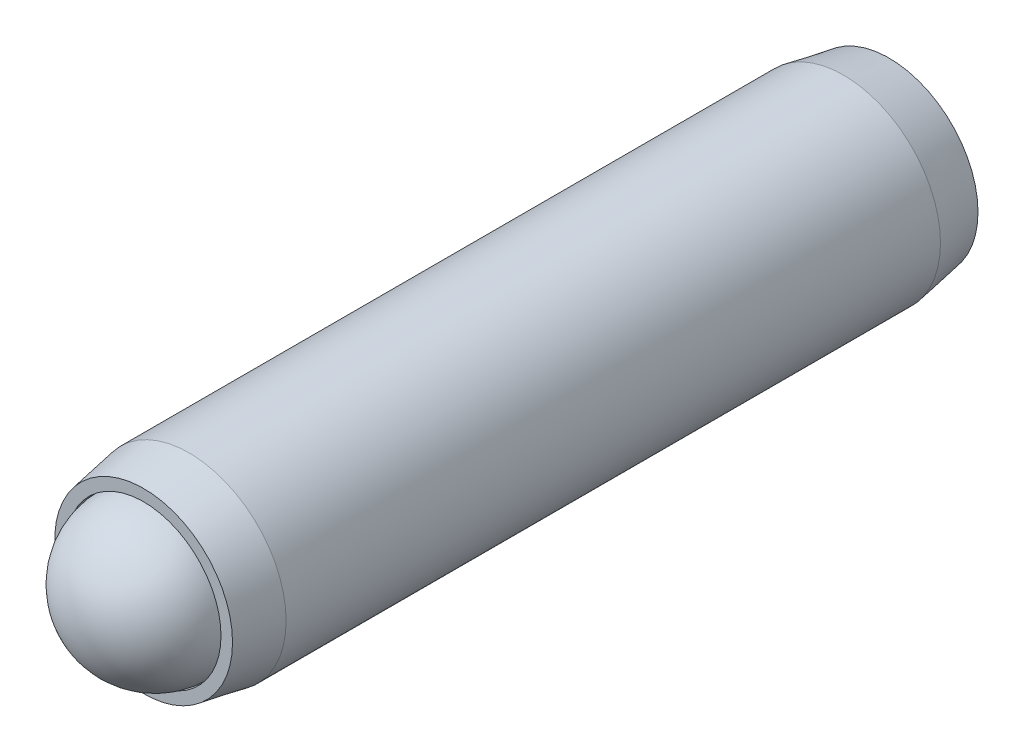
ISO-10303-21;
HEADER;
FILE_DESCRIPTION(('STEP AP214'),'2;1');
FILE_NAME('part.step','',(''),(''),'','','');
FILE_SCHEMA(('AUTOMOTIVE_DESIGN { 1 0 10303 214 1 1 1 1 }'));
ENDSEC;
DATA;
#1=APPLICATION_CONTEXT('core data for automotive mechanical design processes');
#2=APPLICATION_PROTOCOL_DEFINITION('international standard','automotive_design',2000,#1);
#3=PRODUCT_CONTEXT('',#1,'mechanical');
#4=PRODUCT('Part','Part','',(#3));
#5=PRODUCT_RELATED_PRODUCT_CATEGORY('part','',(#4));
#6=PRODUCT_DEFINITION_FORMATION('','',#4);
#7=PRODUCT_DEFINITION_CONTEXT('part definition',#1,'design');
#8=PRODUCT_DEFINITION('design','',#6,#7);
#9=PRODUCT_DEFINITION_SHAPE('','',#8);
#10=(LENGTH_UNIT() NAMED_UNIT(*) SI_UNIT(.MILLI.,.METRE.));
#11=(NAMED_UNIT(*) PLANE_ANGLE_UNIT() SI_UNIT($,.RADIAN.));
#12=(NAMED_UNIT(*) SI_UNIT($,.STERADIAN.) SOLID_ANGLE_UNIT());
#13=UNCERTAINTY_MEASURE_WITH_UNIT(LENGTH_MEASURE(1.E-05),#10,'distance_accuracy_value','');
#14=(GEOMETRIC_REPRESENTATION_CONTEXT(3) GLOBAL_UNCERTAINTY_ASSIGNED_CONTEXT((#13)) GLOBAL_UNIT_ASSIGNED_CONTEXT((#10,
#11,#12)) REPRESENTATION_CONTEXT('',''));
#15=CARTESIAN_POINT('',(0.,0.,0.));
#16=DIRECTION('',(0.,0.,1.));
#17=DIRECTION('',(1.,0.,0.));
#18=AXIS2_PLACEMENT_3D('',#15,#16,#17);
#19=CARTESIAN_POINT('',(0.,0.,11.500000019));
#20=DIRECTION('',(0.,0.,-1.));
#21=DIRECTION('',(-1.,0.,0.));
#22=AXIS2_PLACEMENT_3D('',#19,#20,#21);
#23=CYLINDRICAL_SURFACE('',#22,2.991);
#24=CARTESIAN_POINT('',(0.,0.,10.0946563840987));
#25=DIRECTION('',(0.,0.,1.));
#26=DIRECTION('',(1.,0.,0.));
#27=AXIS2_PLACEMENT_3D('',#24,#25,#26);
#28=CIRCLE('',#27,2.991);
#29=CARTESIAN_POINT('',(2.991,0.,10.0946563840987));
#30=VERTEX_POINT('',#29);
#31=EDGE_CURVE('P0_E184',#30,#30,#28,.T.);
#32=ORIENTED_EDGE('',*,*,#31,.F.);
#33=EDGE_LOOP('',(#32));
#34=FACE_BOUND('',#33,.T.);
#35=CARTESIAN_POINT('',(0.,0.,-10.0946563840987));
#36=DIRECTION('',(0.,0.,1.));
#37=DIRECTION('',(1.,0.,0.));
#38=AXIS2_PLACEMENT_3D('',#35,#36,#37);
#39=CIRCLE('',#38,2.991);
#40=CARTESIAN_POINT('',(2.991,0.,-10.0946563840987));
#41=VERTEX_POINT('',#40);
#42=EDGE_CURVE('P0_E187',#41,#41,#39,.T.);
#43=ORIENTED_EDGE('',*,*,#42,.T.);
#44=EDGE_LOOP('',(#43));
#45=FACE_BOUND('',#44,.T.);
#46=ADVANCED_FACE('P0_F16',(#34,#45),#23,.T.);
#47=CARTESIAN_POINT('',(0.,0.,11.500000019));
#48=DIRECTION('',(0.,0.,-1.));
#49=DIRECTION('',(-1.,0.,0.));
#50=AXIS2_PLACEMENT_3D('',#47,#48,#49);
#51=CONICAL_SURFACE('',#50,2.7432,0.174532925199426);
#52=ORIENTED_EDGE('',*,*,#31,.T.);
#53=EDGE_LOOP('',(#52));
#54=FACE_BOUND('',#53,.T.);
#55=CARTESIAN_POINT('',(0.,0.,11.500000019));
#56=DIRECTION('',(0.,0.,1.));
#57=DIRECTION('',(1.,0.,0.));
#58=AXIS2_PLACEMENT_3D('',#55,#56,#57);
#59=CIRCLE('',#58,2.7432);
#60=CARTESIAN_POINT('',(2.7432,0.,11.500000019));
#61=VERTEX_POINT('',#60);
#62=EDGE_CURVE('P0_E200',#61,#61,#59,.T.);
#63=ORIENTED_EDGE('',*,*,#62,.F.);
#64=EDGE_LOOP('',(#63));
#65=FACE_BOUND('',#64,.T.);
#66=ADVANCED_FACE('P0_F162',(#54,#65),#51,.T.);
#67=CARTESIAN_POINT('',(0.,0.,11.500000019));
#68=DIRECTION('',(0.,0.,1.));
#69=DIRECTION('',(1.,0.,0.));
#70=AXIS2_PLACEMENT_3D('',#67,#68,#69);
#71=PLANE('',#70);
#72=CARTESIAN_POINT('',(0.,0.,11.500000019));
#73=DIRECTION('',(0.,0.,1.));
#74=DIRECTION('',(1.,0.,0.));
#75=AXIS2_PLACEMENT_3D('',#72,#73,#74);
#76=CIRCLE('',#75,2.3876);
#77=CARTESIAN_POINT('',(2.3876,0.,11.500000019));
#78=VERTEX_POINT('',#77);
#79=EDGE_CURVE('P0_E195',#78,#78,#76,.T.);
#80=ORIENTED_EDGE('',*,*,#79,.F.);
#81=EDGE_LOOP('',(#80));
#82=FACE_BOUND('',#81,.T.);
#83=ORIENTED_EDGE('',*,*,#62,.T.);
#84=EDGE_LOOP('',(#83));
#85=FACE_BOUND('',#84,.T.);
#86=ADVANCED_FACE('P0_F159',(#82,#85),#71,.T.);
#87=CARTESIAN_POINT('',(0.,0.,-10.0946563840987));
#88=DIRECTION('',(0.,0.,1.));
#89=DIRECTION('',(1.,0.,0.));
#90=AXIS2_PLACEMENT_3D('',#87,#88,#89);
#91=CONICAL_SURFACE('',#90,2.991,0.174532925199426);
#92=CARTESIAN_POINT('',(0.,0.,-11.500000019));
#93=DIRECTION('',(0.,0.,1.));
#94=DIRECTION('',(1.,0.,0.));
#95=AXIS2_PLACEMENT_3D('',#92,#93,#94);
#96=CIRCLE('',#95,2.7432);
#97=CARTESIAN_POINT('',(2.7432,0.,-11.500000019));
#98=VERTEX_POINT('',#97);
#99=EDGE_CURVE('P0_E189',#98,#98,#96,.T.);
#100=ORIENTED_EDGE('',*,*,#99,.T.);
#101=EDGE_LOOP('',(#100));
#102=FACE_BOUND('',#101,.T.);
#103=ORIENTED_EDGE('',*,*,#42,.F.);
#104=EDGE_LOOP('',(#103));
#105=FACE_BOUND('',#104,.T.);
#106=ADVANCED_FACE('P0_F161',(#102,#105),#91,.T.);
#107=CARTESIAN_POINT('',(0.,0.,-11.500000019));
#108=DIRECTION('',(0.,0.,1.));
#109=DIRECTION('',(1.,0.,0.));
#110=AXIS2_PLACEMENT_3D('',#107,#108,#109);
#111=PLANE('',#110);
#112=CARTESIAN_POINT('',(0.,0.,-11.500000019));
#113=DIRECTION('',(0.,0.,1.));
#114=DIRECTION('',(1.,0.,0.));
#115=AXIS2_PLACEMENT_3D('',#112,#113,#114);
#116=CIRCLE('',#115,1.14567944042316);
#117=CARTESIAN_POINT('',(0.572839720211583,-0.992187499999999,-11.500000019));
#118=VERTEX_POINT('',#117);
#119=CARTESIAN_POINT('',(1.14567944042316,0.,-11.500000019));
#120=VERTEX_POINT('',#119);
#121=EDGE_CURVE('P0_E19',#118,#120,#116,.T.);
#122=ORIENTED_EDGE('',*,*,#121,.T.);
#123=CARTESIAN_POINT('',(0.572839720211582,0.9921875,-11.500000019));
#124=VERTEX_POINT('',#123);
#125=EDGE_CURVE('P0_E11',#120,#124,#116,.T.);
#126=ORIENTED_EDGE('',*,*,#125,.T.);
#127=CARTESIAN_POINT('',(-0.572839720211582,0.9921875,-11.500000019));
#128=VERTEX_POINT('',#127);
#129=EDGE_CURVE('P0_E24',#124,#128,#116,.T.);
#130=ORIENTED_EDGE('',*,*,#129,.T.);
#131=CARTESIAN_POINT('',(0.,0.,-11.500000019));
#132=DIRECTION('',(0.,0.,-1.));
#133=DIRECTION('',(-1.,0.,0.));
#134=AXIS2_PLACEMENT_3D('',#131,#132,#133);
#135=CIRCLE('',#134,1.14567944042316);
#136=CARTESIAN_POINT('',(-1.14567944042316,0.,-11.500000019));
#137=VERTEX_POINT('',#136);
#138=EDGE_CURVE('P0_E77',#137,#128,#135,.T.);
#139=ORIENTED_EDGE('',*,*,#138,.F.);
#140=CARTESIAN_POINT('',(-0.572839720211581,-0.9921875,-11.500000019));
#141=VERTEX_POINT('',#140);
#142=EDGE_CURVE('P0_E85',#137,#141,#116,.T.);
#143=ORIENTED_EDGE('',*,*,#142,.T.);
#144=EDGE_CURVE('P0_E90',#141,#118,#116,.T.);
#145=ORIENTED_EDGE('',*,*,#144,.T.);
#146=EDGE_LOOP('',(#122,#126,#130,#139,#143,#145));
#147=FACE_BOUND('',#146,.T.);
#148=ORIENTED_EDGE('',*,*,#99,.F.);
#149=EDGE_LOOP('',(#148));
#150=FACE_BOUND('',#149,.T.);
#151=ADVANCED_FACE('P0_F91',(#147,#150),#111,.F.);
#152=CARTESIAN_POINT('',(0.,0.,10.1644039735991));
#153=DIRECTION('',(0.,0.,1.));
#154=DIRECTION('',(1.,0.,0.));
#155=AXIS2_PLACEMENT_3D('',#152,#153,#154);
#156=CONICAL_SURFACE('',#155,2.3876,0.78539816339745);
#157=CARTESIAN_POINT('',(0.,0.,7.77680397359907));
#158=VERTEX_POINT('',#157);
#159=VERTEX_LOOP('',#158);
#160=FACE_BOUND('',#159,.T.);
#161=CARTESIAN_POINT('',(0.,0.,10.1644039735991));
#162=DIRECTION('',(0.,0.,1.));
#163=DIRECTION('',(1.,0.,0.));
#164=AXIS2_PLACEMENT_3D('',#161,#162,#163);
#165=CIRCLE('',#164,2.3876);
#166=CARTESIAN_POINT('',(2.3876,0.,10.1644039735991));
#167=VERTEX_POINT('',#166);
#168=EDGE_CURVE('P0_E190',#167,#167,#165,.T.);
#169=ORIENTED_EDGE('',*,*,#168,.T.);
#170=EDGE_LOOP('',(#169));
#171=FACE_BOUND('',#170,.T.);
#172=ADVANCED_FACE('P0_F165',(#160,#171),#156,.F.);
#173=CARTESIAN_POINT('',(0.,0.,11.500000019));
#174=DIRECTION('',(0.,0.,1.));
#175=DIRECTION('',(1.,0.,0.));
#176=AXIS2_PLACEMENT_3D('',#173,#174,#175);
#177=CYLINDRICAL_SURFACE('',#176,2.3876);
#178=ORIENTED_EDGE('',*,*,#168,.F.);
#179=EDGE_LOOP('',(#178));
#180=FACE_BOUND('',#179,.T.);
#181=ORIENTED_EDGE('',*,*,#79,.T.);
#182=EDGE_LOOP('',(#181));
#183=FACE_BOUND('',#182,.T.);
#184=ADVANCED_FACE('P0_F132',(#180,#183),#177,.F.);
#185=CARTESIAN_POINT('',(0.,0.,-11.500000019));
#186=DIRECTION('',(0.,0.,-1.));
#187=DIRECTION('',(-1.,0.,0.));
#188=AXIS2_PLACEMENT_3D('',#185,#186,#187);
#189=CONICAL_SURFACE('',#188,1.14567944042316,0.78539816339745);
#190=ORIENTED_EDGE('',*,*,#121,.F.);
#191=CARTESIAN_POINT('',(1.145794910477,0.000200000000000163,-11.500115506509));
#192=CARTESIAN_POINT('',(1.12609913995856,-0.0339140752321557,-11.4804328304047));
#193=CARTESIAN_POINT('',(1.10607402631377,-0.0685985894922792,-11.4619057035184));
#194=CARTESIAN_POINT('',(1.06524035596264,-0.139324581199959,-11.4279823486504));
#195=CARTESIAN_POINT('',(1.04442791197037,-0.175372791624242,-11.4126050062309));
#196=CARTESIAN_POINT('',(1.00246048249572,-0.248062511737395,-11.3862631617343));
#197=CARTESIAN_POINT('',(0.981316196707012,-0.284685489013201,-11.3752324155131));
#198=CARTESIAN_POINT('',(0.938562244623588,-0.358737506246056,-11.3582362246729));
#199=CARTESIAN_POINT('',(0.916953885244212,-0.396164282559342,-11.3522580865789));
#200=CARTESIAN_POINT('',(0.879714587318154,-0.46066463860547,-11.3468663639143));
#201=CARTESIAN_POINT('',(0.864132099442442,-0.487654299314529,-11.3460690153883));
#202=CARTESIAN_POINT('',(0.832997298779852,-0.541581355945663,-11.3474082123614));
#203=CARTESIAN_POINT('',(0.817444993408173,-0.568518739024239,-11.349545405137));
#204=CARTESIAN_POINT('',(0.771010163908484,-0.648946222958497,-11.360217590306));
#205=CARTESIAN_POINT('',(0.740358726795446,-0.702036069363282,-11.3730143997227));
#206=CARTESIAN_POINT('',(0.68656205513008,-0.795214637965797,-11.4038974866501));
#207=CARTESIAN_POINT('',(0.663164549602744,-0.835740306309516,-11.4203650279077));
#208=CARTESIAN_POINT('',(0.617285982385523,-0.915204315708207,-11.4574604025568));
#209=CARTESIAN_POINT('',(0.594802217831308,-0.954147338261523,-11.4780746996455));
#210=CARTESIAN_POINT('',(0.572724250157744,-0.992387499999999,-11.500115506509));
#211=B_SPLINE_CURVE_WITH_KNOTS('',3,(#191,#192,#193,#194,#195,#196,#197,#198,#199,#200,#201,
#202,#203,#204,#205,#206,#207,#208,#209,#210),.UNSPECIFIED.,.F.,.F.,(4,2,2,2,2,2,2,2,2,4),(0.,
0.13219718521019,0.265165186853262,0.396020097605669,0.526545281028574,0.619935205043264,
0.713345731536164,0.900220051846369,1.04884529769095,1.1969930355767),.UNSPECIFIED.);
#212=EDGE_CURVE('P0_E109',#120,#118,#211,.T.);
#213=ORIENTED_EDGE('',*,*,#212,.F.);
#214=EDGE_LOOP('',(#190,#213));
#215=FACE_BOUND('',#214,.T.);
#216=ADVANCED_FACE('P0_F127',(#215),#189,.F.);
#217=ORIENTED_EDGE('',*,*,#144,.F.);
#218=CARTESIAN_POINT('',(-1.14247621095534,-0.9921875,-11.8674920585338));
#219=CARTESIAN_POINT('',(-1.11465764817297,-0.9921875,-11.8464916583704));
#220=CARTESIAN_POINT('',(-1.08668408109739,-0.9921875,-11.8256971668216));
#221=CARTESIAN_POINT('',(-1.03036405380652,-0.9921875,-11.7846050567931));
#222=CARTESIAN_POINT('',(-1.00201750238008,-0.9921875,-11.7643075634585));
#223=CARTESIAN_POINT('',(-0.915909012474785,-0.9921875,-11.7039985265809));
#224=CARTESIAN_POINT('',(-0.857501195957519,-0.9921875,-11.66489387125));
#225=CARTESIAN_POINT('',(-0.735022281337406,-0.9921875,-11.5881267718187));
#226=CARTESIAN_POINT('',(-0.670818221979873,-0.9921875,-11.5506740500437));
#227=CARTESIAN_POINT('',(-0.539203244273796,-0.9921875,-11.4821650394898));
#228=CARTESIAN_POINT('',(-0.471804119013398,-0.9921875,-11.4510871872744));
#229=CARTESIAN_POINT('',(-0.370637445291612,-0.9921875,-11.41306631525));
#230=CARTESIAN_POINT('',(-0.338367677294405,-0.9921875,-11.4021540513464));
#231=CARTESIAN_POINT('',(-0.273049086298105,-0.9921875,-11.382920249113));
#232=CARTESIAN_POINT('',(-0.240000209797913,-0.9921875,-11.3745988892603));
#233=CARTESIAN_POINT('',(-0.17387839587922,-0.9921875,-11.3611187926932));
#234=CARTESIAN_POINT('',(-0.140816774783575,-0.9921875,-11.3559054129747));
#235=CARTESIAN_POINT('',(-0.0743291672741469,-0.9921875,-11.3487397314628));
#236=CARTESIAN_POINT('',(-0.0409031260707386,-0.9921875,-11.3467879270388));
#237=CARTESIAN_POINT('',(0.0247631140270445,-0.9921875,-11.3462935049037));
#238=CARTESIAN_POINT('',(0.0570024444112249,-0.9921875,-11.3476300504157));
#239=CARTESIAN_POINT('',(0.121194220405733,-0.9921875,-11.3533710622024));
#240=CARTESIAN_POINT('',(0.15314673026799,-0.9921875,-11.3577748230789));
#241=CARTESIAN_POINT('',(0.21709052455367,-0.9921875,-11.3694845301375));
#242=CARTESIAN_POINT('',(0.249072542042748,-0.9921875,-11.3768403214107));
#243=CARTESIAN_POINT('',(0.312337779646054,-0.9921875,-11.3940631103517));
#244=CARTESIAN_POINT('',(0.343621057993189,-0.9921875,-11.4039298978974));
#245=CARTESIAN_POINT('',(0.442112982998623,-0.9921875,-11.4387061305409));
#246=CARTESIAN_POINT('',(0.507919771037745,-0.9921875,-11.467576183078));
#247=CARTESIAN_POINT('',(0.63644189098175,-0.9921875,-11.5317652288148));
#248=CARTESIAN_POINT('',(0.699145053739843,-0.9921875,-11.5671073910824));
#249=CARTESIAN_POINT('',(0.818979829838881,-0.9921875,-11.6400213897045));
#250=CARTESIAN_POINT('',(0.876233471440126,-0.9921875,-11.6773951538683));
#251=CARTESIAN_POINT('',(0.960585190489399,-0.9921875,-11.7351711306989));
#252=CARTESIAN_POINT('',(0.988338378120949,-0.9921875,-11.754633506457));
#253=CARTESIAN_POINT('',(1.04346551309539,-0.9921875,-11.7940730005409));
#254=CARTESIAN_POINT('',(1.070839562073,-0.9921875,-11.8140499766456));
#255=CARTESIAN_POINT('',(1.09805574489947,-0.9921875,-11.8342403243952));
#256=B_SPLINE_CURVE_WITH_KNOTS('',3,(#218,#219,#220,#221,#222,#223,#224,#225,#226,#227,#228,
#229,#230,#231,#232,#233,#234,#235,#236,#237,#238,#239,#240,#241,#242,#243,#244,#245,#246,#247,
#248,#249,#250,#251,#252,#253,#254,#255),.UNSPECIFIED.,.F.,.F.,(4,2,2,2,2,2,2,2,2,2,2,2,2,2,2,2,
2,2,4),(0.,0.104563127391606,0.209152318718919,0.419927099055485,0.642732653996012,
0.864771652302187,0.966879847198757,1.06899507437088,1.1692575299655,1.2695352735478,
1.36618351698525,1.4628095406014,1.56114078104352,1.65946379575192,1.87441437169281,
2.090150036015,2.29516517561955,2.39685303361285,2.4985130831926),.UNSPECIFIED.);
#257=EDGE_CURVE('P0_E107',#118,#141,#256,.F.);
#258=ORIENTED_EDGE('',*,*,#257,.F.);
#259=EDGE_LOOP('',(#217,#258));
#260=FACE_BOUND('',#259,.T.);
#261=ADVANCED_FACE('P0_F131',(#260),#189,.F.);
#262=ORIENTED_EDGE('',*,*,#142,.F.);
#263=CARTESIAN_POINT('',(-0.572724250157744,-0.9923875,-11.500115506509));
#264=CARTESIAN_POINT('',(-0.592420020676184,-0.958273424767844,-11.4804328304047));
#265=CARTESIAN_POINT('',(-0.612445134320978,-0.923588910507721,-11.4619057035184));
#266=CARTESIAN_POINT('',(-0.65327880467211,-0.852862918800041,-11.4279823486504));
#267=CARTESIAN_POINT('',(-0.674091248664374,-0.816814708375758,-11.4126050062309));
#268=CARTESIAN_POINT('',(-0.716058678139021,-0.744124988262605,-11.3862631617343));
#269=CARTESIAN_POINT('',(-0.737202963927733,-0.7075020109868,-11.3752324155131));
#270=CARTESIAN_POINT('',(-0.779956916011157,-0.633449993753945,-11.3582362246729));
#271=CARTESIAN_POINT('',(-0.801565275390533,-0.596023217440658,-11.3522580865789));
#272=CARTESIAN_POINT('',(-0.838804573316591,-0.53152286139453,-11.3468663639143));
#273=CARTESIAN_POINT('',(-0.854387061192303,-0.504533200685471,-11.3460690153883));
#274=CARTESIAN_POINT('',(-0.885521861854893,-0.450606144054336,-11.3474082123614));
#275=CARTESIAN_POINT('',(-0.901074167226572,-0.423668760975761,-11.349545405137));
#276=CARTESIAN_POINT('',(-0.94750899672626,-0.343241277041503,-11.360217590306));
#277=CARTESIAN_POINT('',(-0.978160433839299,-0.290151430636718,-11.3730143997227));
#278=CARTESIAN_POINT('',(-1.03195710550467,-0.196972862034203,-11.4038974866501));
#279=CARTESIAN_POINT('',(-1.055354611032,-0.156447193690484,-11.4203650279077));
#280=CARTESIAN_POINT('',(-1.10123317824922,-0.0769831842917928,-11.4574604025568));
#281=CARTESIAN_POINT('',(-1.12371694280344,-0.0380401617384767,-11.4780746996455));
#282=CARTESIAN_POINT('',(-1.145794910477,0.000199999999999656,-11.500115506509));
#283=B_SPLINE_CURVE_WITH_KNOTS('',3,(#263,#264,#265,#266,#267,#268,#269,#270,#271,#272,#273,
#274,#275,#276,#277,#278,#279,#280,#281,#282),.UNSPECIFIED.,.F.,.F.,(4,2,2,2,2,2,2,2,2,4),(0.,
0.132197185210189,0.265165186853262,0.396020097605668,0.526545281028573,0.619935205043264,
0.713345731536163,0.900220051846368,1.04884529769095,1.19699303557669),.UNSPECIFIED.);
#284=EDGE_CURVE('P0_E80',#141,#137,#283,.T.);
#285=ORIENTED_EDGE('',*,*,#284,.F.);
#286=EDGE_LOOP('',(#262,#285));
#287=FACE_BOUND('',#286,.T.);
#288=ADVANCED_FACE('P0_F86',(#287),#189,.F.);
#289=ORIENTED_EDGE('',*,*,#138,.T.);
#290=CARTESIAN_POINT('',(-1.145794910477,-0.000200000000000018,-11.500115506509));
#291=CARTESIAN_POINT('',(-1.12609913995856,0.0339140752321558,-11.4804328304047));
#292=CARTESIAN_POINT('',(-1.10607402631377,0.0685985894922792,-11.4619057035184));
#293=CARTESIAN_POINT('',(-1.06524035596264,0.139324581199959,-11.4279823486504));
#294=CARTESIAN_POINT('',(-1.04442791197037,0.175372791624242,-11.4126050062309));
#295=CARTESIAN_POINT('',(-1.00246048249572,0.248062511737395,-11.3862631617343));
#296=CARTESIAN_POINT('',(-0.981316196707012,0.2846854890132,-11.3752324155131));
#297=CARTESIAN_POINT('',(-0.938562244623589,0.358737506246055,-11.3582362246729));
#298=CARTESIAN_POINT('',(-0.916953885244213,0.396164282559342,-11.3522580865789));
#299=CARTESIAN_POINT('',(-0.879714587318154,0.46066463860547,-11.3468663639143));
#300=CARTESIAN_POINT('',(-0.864132099442442,0.487654299314528,-11.3460690153883));
#301=CARTESIAN_POINT('',(-0.832997298779853,0.541581355945663,-11.3474082123614));
#302=CARTESIAN_POINT('',(-0.817444993408173,0.568518739024238,-11.349545405137));
#303=CARTESIAN_POINT('',(-0.771010163908485,0.648946222958496,-11.360217590306));
#304=CARTESIAN_POINT('',(-0.740358726795446,0.702036069363281,-11.3730143997227));
#305=CARTESIAN_POINT('',(-0.68656205513008,0.795214637965796,-11.4038974866501));
#306=CARTESIAN_POINT('',(-0.663164549602745,0.835740306309515,-11.4203650279077));
#307=CARTESIAN_POINT('',(-0.617285982385523,0.915204315708207,-11.4574604025568));
#308=CARTESIAN_POINT('',(-0.594802217831308,0.954147338261523,-11.4780746996455));
#309=CARTESIAN_POINT('',(-0.572724250157744,0.9923875,-11.500115506509));
#310=B_SPLINE_CURVE_WITH_KNOTS('',3,(#290,#291,#292,#293,#294,#295,#296,#297,#298,#299,#300,
#301,#302,#303,#304,#305,#306,#307,#308,#309),.UNSPECIFIED.,.F.,.F.,(4,2,2,2,2,2,2,2,2,4),(0.,
0.132197185210189,0.265165186853262,0.396020097605669,0.526545281028573,0.619935205043263,
0.713345731536163,0.900220051846368,1.04884529769095,1.1969930355767),.UNSPECIFIED.);
#311=EDGE_CURVE('P0_E73',#137,#128,#310,.T.);
#312=ORIENTED_EDGE('',*,*,#311,.F.);
#313=EDGE_LOOP('',(#289,#312));
#314=FACE_BOUND('',#313,.T.);
#315=ADVANCED_FACE('P0_F75',(#314),#189,.F.);
#316=ORIENTED_EDGE('',*,*,#129,.F.);
#317=CARTESIAN_POINT('',(-1.14247621078911,0.9921875,-11.8674920584083));
#318=CARTESIAN_POINT('',(-1.11465764801141,0.9921875,-11.8464916582497));
#319=CARTESIAN_POINT('',(-1.08668408094051,0.9921875,-11.8256971667058));
#320=CARTESIAN_POINT('',(-1.03036405365905,0.9921875,-11.7846050566869));
#321=CARTESIAN_POINT('',(-1.00201750223733,0.9921875,-11.7643075633571));
#322=CARTESIAN_POINT('',(-0.915909012346497,0.9921875,-11.7039985264939));
#323=CARTESIAN_POINT('',(-0.857501195839068,0.9921875,-11.6648938711726));
#324=CARTESIAN_POINT('',(-0.735022281240406,0.9921875,-11.5881267717611));
#325=CARTESIAN_POINT('',(-0.670818221894544,0.9921875,-11.5506740499963));
#326=CARTESIAN_POINT('',(-0.539203244212804,0.9921875,-11.482165039461));
#327=CARTESIAN_POINT('',(-0.471804118965062,0.9921875,-11.4510871872543));
#328=CARTESIAN_POINT('',(-0.370637445252798,0.9921875,-11.4130663152363));
#329=CARTESIAN_POINT('',(-0.338367677251604,0.9921875,-11.4021540513325));
#330=CARTESIAN_POINT('',(-0.273049086247197,0.9921875,-11.3829202490993));
#331=CARTESIAN_POINT('',(-0.240000209742887,0.9921875,-11.3745988892472));
#332=CARTESIAN_POINT('',(-0.173878395816094,0.9921875,-11.3611187926821));
#333=CARTESIAN_POINT('',(-0.140816774716471,0.9921875,-11.3559054129651));
#334=CARTESIAN_POINT('',(-0.0743291671992148,0.9921875,-11.3487397314571));
#335=CARTESIAN_POINT('',(-0.0409031259919581,0.9921875,-11.3467879270354));
#336=CARTESIAN_POINT('',(0.0247631141129246,0.9921875,-11.3462935049057));
#337=CARTESIAN_POINT('',(0.0570024445003661,0.9921875,-11.3476300504208));
#338=CARTESIAN_POINT('',(0.12119422050107,0.9921875,-11.3533710622138));
#339=CARTESIAN_POINT('',(0.153146730366262,0.9921875,-11.3577748230939));
#340=CARTESIAN_POINT('',(0.217090524657736,0.9921875,-11.3694845301597));
#341=CARTESIAN_POINT('',(0.249072542149665,0.9921875,-11.3768403214366));
#342=CARTESIAN_POINT('',(0.312337779758396,0.9921875,-11.3940631103854));
#343=CARTESIAN_POINT('',(0.343621058108106,0.9921875,-11.403929897935));
#344=CARTESIAN_POINT('',(0.442112983138562,0.9921875,-11.4387061305969));
#345=CARTESIAN_POINT('',(0.50791977119888,0.9921875,-11.4675761831508));
#346=CARTESIAN_POINT('',(0.636441891183645,0.9921875,-11.5317652289233));
#347=CARTESIAN_POINT('',(0.699145053961295,0.9921875,-11.5671073912097));
#348=CARTESIAN_POINT('',(0.818979830095495,0.9921875,-11.6400213898677));
#349=CARTESIAN_POINT('',(0.87623347171247,0.9921875,-11.6773951540485));
#350=CARTESIAN_POINT('',(0.960585190785,0.9921875,-11.7351711309045));
#351=CARTESIAN_POINT('',(0.98833837842419,0.9921875,-11.754633506671));
#352=CARTESIAN_POINT('',(1.04346551341387,0.9921875,-11.7940730007717));
#353=CARTESIAN_POINT('',(1.07083956239906,0.9921875,-11.8140499768848));
#354=CARTESIAN_POINT('',(1.09805574523311,0.9921875,-11.8342403246427));
#355=B_SPLINE_CURVE_WITH_KNOTS('',3,(#317,#318,#319,#320,#321,#322,#323,#324,#325,#326,#327,
#328,#329,#330,#331,#332,#333,#334,#335,#336,#337,#338,#339,#340,#341,#342,#343,#344,#345,#346,
#347,#348,#349,#350,#351,#352,#353,#354),.UNSPECIFIED.,.F.,.F.,(4,2,2,2,2,2,2,2,2,2,2,2,2,2,2,2,
2,2,4),(0.,0.104563127371704,0.209152318679109,0.419927098975113,0.642732653870156,
0.864771652131278,0.96687984703938,1.06899507422301,1.16925752982867,1.26953527342202,
1.36618351686957,1.46280954049584,1.56114078094885,1.65946379566814,1.87441437168727,
2.09015003608822,2.29516517576017,2.39685303378669,2.49851308339968),.UNSPECIFIED.);
#356=EDGE_CURVE('P0_E81',#128,#124,#355,.T.);
#357=ORIENTED_EDGE('',*,*,#356,.F.);
#358=EDGE_LOOP('',(#316,#357));
#359=FACE_BOUND('',#358,.T.);
#360=ADVANCED_FACE('P0_F231',(#359),#189,.F.);
#361=ORIENTED_EDGE('',*,*,#125,.F.);
#362=CARTESIAN_POINT('',(0.572724250157744,0.9923875,-11.500115506509));
#363=CARTESIAN_POINT('',(0.592420020676184,0.958273424767844,-11.4804328304047));
#364=CARTESIAN_POINT('',(0.612445134320978,0.923588910507721,-11.4619057035184));
#365=CARTESIAN_POINT('',(0.65327880467211,0.852862918800041,-11.4279823486504));
#366=CARTESIAN_POINT('',(0.674091248664374,0.816814708375758,-11.4126050062309));
#367=CARTESIAN_POINT('',(0.716058678139022,0.744124988262605,-11.3862631617343));
#368=CARTESIAN_POINT('',(0.737202963927733,0.7075020109868,-11.3752324155131));
#369=CARTESIAN_POINT('',(0.779956916011157,0.633449993753945,-11.3582362246729));
#370=CARTESIAN_POINT('',(0.801565275390533,0.596023217440658,-11.3522580865789));
#371=CARTESIAN_POINT('',(0.838804573316592,0.53152286139453,-11.3468663639143));
#372=CARTESIAN_POINT('',(0.854387061192303,0.504533200685472,-11.3460690153883));
#373=CARTESIAN_POINT('',(0.885521861854893,0.450606144054337,-11.3474082123614));
#374=CARTESIAN_POINT('',(0.901074167226572,0.423668760975762,-11.349545405137));
#375=CARTESIAN_POINT('',(0.94750899672626,0.343241277041504,-11.360217590306));
#376=CARTESIAN_POINT('',(0.978160433839299,0.290151430636718,-11.3730143997227));
#377=CARTESIAN_POINT('',(1.03195710550467,0.196972862034204,-11.4038974866501));
#378=CARTESIAN_POINT('',(1.055354611032,0.156447193690484,-11.4203650279077));
#379=CARTESIAN_POINT('',(1.10123317824922,0.0769831842917932,-11.4574604025568));
#380=CARTESIAN_POINT('',(1.12371694280344,0.0380401617384766,-11.4780746996455));
#381=CARTESIAN_POINT('',(1.145794910477,-0.000200000000000295,-11.500115506509));
#382=B_SPLINE_CURVE_WITH_KNOTS('',3,(#362,#363,#364,#365,#366,#367,#368,#369,#370,#371,#372,
#373,#374,#375,#376,#377,#378,#379,#380,#381),.UNSPECIFIED.,.F.,.F.,(4,2,2,2,2,2,2,2,2,4),(0.,
0.13219718521019,0.265165186853262,0.396020097605669,0.526545281028573,0.619935205043263,
0.713345731536163,0.900220051846368,1.04884529769095,1.1969930355767),.UNSPECIFIED.);
#383=EDGE_CURVE('P0_E94',#124,#120,#382,.T.);
#384=ORIENTED_EDGE('',*,*,#383,.F.);
#385=EDGE_LOOP('',(#361,#384));
#386=FACE_BOUND('',#385,.T.);
#387=ADVANCED_FACE('P0_F134',(#386),#189,.F.);
#388=CARTESIAN_POINT('',(0.,0.,-8.452000019));
#389=DIRECTION('',(0.,0.,-1.));
#390=DIRECTION('',(-1.,0.,0.));
#391=AXIS2_PLACEMENT_3D('',#388,#389,#390);
#392=PLANE('',#391);
#393=DIRECTION('',(1.,0.,0.));
#394=VECTOR('',#393,1.);
#395=CARTESIAN_POINT('',(-0.572839720211582,0.9921875,-8.452000019));
#396=LINE('',#395,#394);
#397=CARTESIAN_POINT('',(-0.572839720211582,0.9921875,-8.452000019));
#398=VERTEX_POINT('',#397);
#399=CARTESIAN_POINT('',(0.572839720211582,0.9921875,-8.452000019));
#400=VERTEX_POINT('',#399);
#401=EDGE_CURVE('P0_E203',#398,#400,#396,.T.);
#402=ORIENTED_EDGE('',*,*,#401,.T.);
#403=DIRECTION('',(0.5,-0.866025403784439,0.));
#404=VECTOR('',#403,1.);
#405=CARTESIAN_POINT('',(0.572839720211582,0.9921875,-8.452000019));
#406=LINE('',#405,#404);
#407=CARTESIAN_POINT('',(1.14567944042316,0.,-8.452000019));
#408=VERTEX_POINT('',#407);
#409=EDGE_CURVE('P0_E206',#400,#408,#406,.T.);
#410=ORIENTED_EDGE('',*,*,#409,.T.);
#411=DIRECTION('',(-0.5,-0.866025403784438,0.));
#412=VECTOR('',#411,1.);
#413=CARTESIAN_POINT('',(1.14567944042316,0.,-8.452000019));
#414=LINE('',#413,#412);
#415=CARTESIAN_POINT('',(0.572839720211582,-0.9921875,-8.452000019));
#416=VERTEX_POINT('',#415);
#417=EDGE_CURVE('P0_E209',#408,#416,#414,.T.);
#418=ORIENTED_EDGE('',*,*,#417,.T.);
#419=DIRECTION('',(-1.,0.,0.));
#420=VECTOR('',#419,1.);
#421=CARTESIAN_POINT('',(0.572839720211582,-0.9921875,-8.452000019));
#422=LINE('',#421,#420);
#423=CARTESIAN_POINT('',(-0.572839720211582,-0.9921875,-8.452000019));
#424=VERTEX_POINT('',#423);
#425=EDGE_CURVE('P0_E212',#416,#424,#422,.T.);
#426=ORIENTED_EDGE('',*,*,#425,.T.);
#427=DIRECTION('',(-0.5,0.866025403784439,0.));
#428=VECTOR('',#427,1.);
#429=CARTESIAN_POINT('',(-0.572839720211582,-0.9921875,-8.452000019));
#430=LINE('',#429,#428);
#431=CARTESIAN_POINT('',(-1.14567944042316,0.,-8.452000019));
#432=VERTEX_POINT('',#431);
#433=EDGE_CURVE('P0_E215',#424,#432,#430,.T.);
#434=ORIENTED_EDGE('',*,*,#433,.T.);
#435=DIRECTION('',(0.5,0.866025403784439,0.));
#436=VECTOR('',#435,1.);
#437=CARTESIAN_POINT('',(-1.14567944042316,0.,-8.452000019));
#438=LINE('',#437,#436);
#439=EDGE_CURVE('P0_E99',#432,#398,#438,.T.);
#440=ORIENTED_EDGE('',*,*,#439,.T.);
#441=EDGE_LOOP('',(#402,#410,#418,#426,#434,#440));
#442=FACE_BOUND('',#441,.T.);
#443=ADVANCED_FACE('P0_F240',(#442),#392,.T.);
#444=CARTESIAN_POINT('',(0.572839720211582,0.9921875,-8.452000019));
#445=DIRECTION('',(0.866025403784439,0.5,0.));
#446=DIRECTION('',(-0.5,0.866025403784439,0.));
#447=AXIS2_PLACEMENT_3D('',#444,#445,#446);
#448=PLANE('',#447);
#449=DIRECTION('',(0.,0.,-1.));
#450=VECTOR('',#449,1.);
#451=CARTESIAN_POINT('',(0.572839720211582,0.9921875,-8.452000019));
#452=LINE('',#451,#450);
#453=EDGE_CURVE('P0_E218',#400,#124,#452,.T.);
#454=ORIENTED_EDGE('',*,*,#453,.T.);
#455=ORIENTED_EDGE('',*,*,#383,.T.);
#456=DIRECTION('',(0.,0.,-1.));
#457=VECTOR('',#456,1.);
#458=CARTESIAN_POINT('',(1.14567944042316,0.,-8.452000019));
#459=LINE('',#458,#457);
#460=EDGE_CURVE('P0_E224',#408,#120,#459,.T.);
#461=ORIENTED_EDGE('',*,*,#460,.F.);
#462=ORIENTED_EDGE('',*,*,#409,.F.);
#463=EDGE_LOOP('',(#454,#455,#461,#462));
#464=FACE_BOUND('',#463,.T.);
#465=ADVANCED_FACE('P0_F155',(#464),#448,.F.);
#466=CARTESIAN_POINT('',(-0.572839720211582,0.9921875,-8.452000019));
#467=DIRECTION('',(0.,1.,0.));
#468=DIRECTION('',(0.,0.,1.));
#469=AXIS2_PLACEMENT_3D('',#466,#467,#468);
#470=PLANE('',#469);
#471=DIRECTION('',(0.,0.,-1.));
#472=VECTOR('',#471,1.);
#473=CARTESIAN_POINT('',(-0.572839720211582,0.9921875,-8.452000019));
#474=LINE('',#473,#472);
#475=EDGE_CURVE('P0_E37',#398,#128,#474,.T.);
#476=ORIENTED_EDGE('',*,*,#475,.T.);
#477=ORIENTED_EDGE('',*,*,#356,.T.);
#478=ORIENTED_EDGE('',*,*,#453,.F.);
#479=ORIENTED_EDGE('',*,*,#401,.F.);
#480=EDGE_LOOP('',(#476,#477,#478,#479));
#481=FACE_BOUND('',#480,.T.);
#482=ADVANCED_FACE('P0_F151',(#481),#470,.F.);
#483=CARTESIAN_POINT('',(-1.14567944042316,0.,-8.452000019));
#484=DIRECTION('',(-0.866025403784439,0.5,0.));
#485=DIRECTION('',(-0.5,-0.866025403784439,0.));
#486=AXIS2_PLACEMENT_3D('',#483,#484,#485);
#487=PLANE('',#486);
#488=DIRECTION('',(0.,0.,-1.));
#489=VECTOR('',#488,1.);
#490=CARTESIAN_POINT('',(-1.14567944042316,0.,-8.452000019));
#491=LINE('',#490,#489);
#492=EDGE_CURVE('P0_E96',#432,#137,#491,.T.);
#493=ORIENTED_EDGE('',*,*,#492,.T.);
#494=ORIENTED_EDGE('',*,*,#311,.T.);
#495=ORIENTED_EDGE('',*,*,#475,.F.);
#496=ORIENTED_EDGE('',*,*,#439,.F.);
#497=EDGE_LOOP('',(#493,#494,#495,#496));
#498=FACE_BOUND('',#497,.T.);
#499=ADVANCED_FACE('P0_F97',(#498),#487,.F.);
#500=CARTESIAN_POINT('',(-0.572839720211582,-0.9921875,-8.452000019));
#501=DIRECTION('',(-0.866025403784439,-0.5,0.));
#502=DIRECTION('',(0.5,-0.866025403784439,0.));
#503=AXIS2_PLACEMENT_3D('',#500,#501,#502);
#504=PLANE('',#503);
#505=DIRECTION('',(0.,0.,-1.));
#506=VECTOR('',#505,1.);
#507=CARTESIAN_POINT('',(-0.572839720211582,-0.9921875,-8.452000019));
#508=LINE('',#507,#506);
#509=EDGE_CURVE('P0_E103',#424,#141,#508,.T.);
#510=ORIENTED_EDGE('',*,*,#509,.T.);
#511=ORIENTED_EDGE('',*,*,#284,.T.);
#512=ORIENTED_EDGE('',*,*,#492,.F.);
#513=ORIENTED_EDGE('',*,*,#433,.F.);
#514=EDGE_LOOP('',(#510,#511,#512,#513));
#515=FACE_BOUND('',#514,.T.);
#516=ADVANCED_FACE('P0_F105',(#515),#504,.F.);
#517=CARTESIAN_POINT('',(0.572839720211582,-0.9921875,-8.452000019));
#518=DIRECTION('',(0.,-1.,0.));
#519=DIRECTION('',(1.,0.,0.));
#520=AXIS2_PLACEMENT_3D('',#517,#518,#519);
#521=PLANE('',#520);
#522=DIRECTION('',(0.,0.,-1.));
#523=VECTOR('',#522,1.);
#524=CARTESIAN_POINT('',(0.572839720211582,-0.9921875,-8.452000019));
#525=LINE('',#524,#523);
#526=EDGE_CURVE('P0_E221',#416,#118,#525,.T.);
#527=ORIENTED_EDGE('',*,*,#526,.T.);
#528=ORIENTED_EDGE('',*,*,#257,.T.);
#529=ORIENTED_EDGE('',*,*,#509,.F.);
#530=ORIENTED_EDGE('',*,*,#425,.F.);
#531=EDGE_LOOP('',(#527,#528,#529,#530));
#532=FACE_BOUND('',#531,.T.);
#533=ADVANCED_FACE('P0_F242',(#532),#521,.F.);
#534=CARTESIAN_POINT('',(1.14567944042316,0.,-8.452000019));
#535=DIRECTION('',(0.866025403784438,-0.5,0.));
#536=DIRECTION('',(0.5,0.866025403784439,0.));
#537=AXIS2_PLACEMENT_3D('',#534,#535,#536);
#538=PLANE('',#537);
#539=ORIENTED_EDGE('',*,*,#460,.T.);
#540=ORIENTED_EDGE('',*,*,#212,.T.);
#541=ORIENTED_EDGE('',*,*,#526,.F.);
#542=ORIENTED_EDGE('',*,*,#417,.F.);
#543=EDGE_LOOP('',(#539,#540,#541,#542));
#544=FACE_BOUND('',#543,.T.);
#545=ADVANCED_FACE('P0_F237',(#544),#538,.F.);
#546=CLOSED_SHELL('',(#46,#66,#86,#106,#151,#172,#184,#216,#261,#288,#315,#360,#387,#443,#465,
#482,#499,#516,#533,#545));
#547=MANIFOLD_SOLID_BREP('P0_B1',#546);
#548=CARTESIAN_POINT('',(0.,0.,11.144400019));
#549=DIRECTION('',(0.,1.,0.));
#550=DIRECTION('',(1.,0.,0.));
#551=AXIS2_PLACEMENT_3D('',#548,#549,#550);
#552=SPHERICAL_SURFACE('',#551,2.38125);
#553=CARTESIAN_POINT('',(0.,0.,11.144400019));
#554=DIRECTION('',(0.,0.,-1.));
#555=DIRECTION('',(1.,0.,0.));
#556=AXIS2_PLACEMENT_3D('',#553,#554,#555);
#557=SPHERICAL_SURFACE('',#556,2.38125);
#558=CARTESIAN_POINT('',(0.,0.,11.144400019));
#559=DIRECTION('',(0.,0.,-1.));
#560=DIRECTION('',(1.,0.,0.));
#561=AXIS2_PLACEMENT_3D('',#558,#559,#560);
#562=CIRCLE('',#561,2.38125);
#563=CARTESIAN_POINT('',(2.38125,0.,11.144400019));
#564=VERTEX_POINT('',#563);
#565=EDGE_CURVE('P1_E9',#564,#564,#562,.T.);
#566=ORIENTED_EDGE('',*,*,#565,.T.);
#567=EDGE_LOOP('',(#566));
#568=FACE_BOUND('',#567,.T.);
#569=ADVANCED_FACE('P1_F13',(#568),#557,.T.);
#570=CARTESIAN_POINT('',(0.,0.,11.144400019));
#571=DIRECTION('',(0.,0.,-1.));
#572=DIRECTION('',(1.,0.,0.));
#573=AXIS2_PLACEMENT_3D('',#570,#571,#572);
#574=SPHERICAL_SURFACE('',#573,2.38125);
#575=ORIENTED_EDGE('',*,*,#565,.F.);
#576=EDGE_LOOP('',(#575));
#577=FACE_BOUND('',#576,.T.);
#578=ADVANCED_FACE('P1_F15',(#577),#574,.T.);
#579=CLOSED_SHELL('',(#569,#578));
#580=MANIFOLD_SOLID_BREP('P1_B1',#579);
#581=ADVANCED_BREP_SHAPE_REPRESENTATION('',(#18,#547,#580),#14);
#582=SHAPE_DEFINITION_REPRESENTATION(#9,#581);
ENDSEC;
END-ISO-10303-21;
